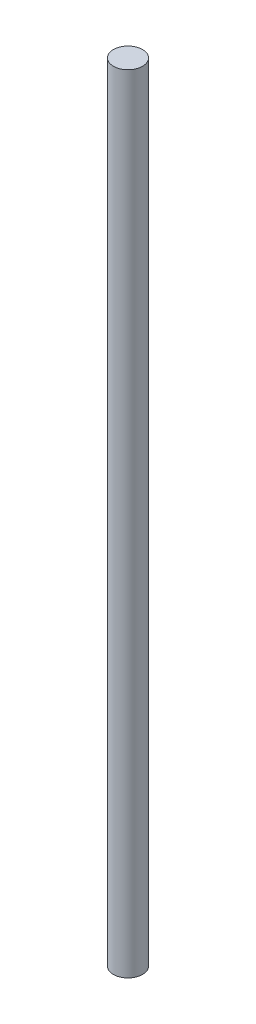
ISO-10303-21;
HEADER;
FILE_DESCRIPTION(('STEP AP214'),'2;1');
FILE_NAME('part.step','',(''),(''),'','','');
FILE_SCHEMA(('AUTOMOTIVE_DESIGN { 1 0 10303 214 1 1 1 1 }'));
ENDSEC;
DATA;
#1=APPLICATION_CONTEXT('core data for automotive mechanical design processes');
#2=APPLICATION_PROTOCOL_DEFINITION('international standard','automotive_design',2000,#1);
#3=PRODUCT_CONTEXT('',#1,'mechanical');
#4=PRODUCT('Part','Part','',(#3));
#5=PRODUCT_RELATED_PRODUCT_CATEGORY('part','',(#4));
#6=PRODUCT_DEFINITION_FORMATION('','',#4);
#7=PRODUCT_DEFINITION_CONTEXT('part definition',#1,'design');
#8=PRODUCT_DEFINITION('design','',#6,#7);
#9=PRODUCT_DEFINITION_SHAPE('','',#8);
#10=(LENGTH_UNIT() NAMED_UNIT(*) SI_UNIT(.MILLI.,.METRE.));
#11=(NAMED_UNIT(*) PLANE_ANGLE_UNIT() SI_UNIT($,.RADIAN.));
#12=(NAMED_UNIT(*) SI_UNIT($,.STERADIAN.) SOLID_ANGLE_UNIT());
#13=UNCERTAINTY_MEASURE_WITH_UNIT(LENGTH_MEASURE(1.E-05),#10,'distance_accuracy_value','');
#14=(GEOMETRIC_REPRESENTATION_CONTEXT(3) GLOBAL_UNCERTAINTY_ASSIGNED_CONTEXT((#13)) GLOBAL_UNIT_ASSIGNED_CONTEXT((#10,
#11,#12)) REPRESENTATION_CONTEXT('',''));
#15=CARTESIAN_POINT('',(0.,0.,0.));
#16=DIRECTION('',(0.,0.,1.));
#17=DIRECTION('',(1.,0.,0.));
#18=AXIS2_PLACEMENT_3D('',#15,#16,#17);
#19=CARTESIAN_POINT('',(0.,265.,0.));
#20=DIRECTION('',(0.,-1.,0.));
#21=DIRECTION('',(0.,0.,-1.));
#22=AXIS2_PLACEMENT_3D('',#19,#20,#21);
#23=CYLINDRICAL_SURFACE('',#22,4.9);
#24=CARTESIAN_POINT('',(0.,265.,0.));
#25=DIRECTION('',(0.,1.,0.));
#26=DIRECTION('',(0.,0.,1.));
#27=AXIS2_PLACEMENT_3D('',#24,#25,#26);
#28=CIRCLE('',#27,4.9);
#29=CARTESIAN_POINT('',(0.,265.,4.9));
#30=VERTEX_POINT('',#29);
#31=EDGE_CURVE('E10',#30,#30,#28,.T.);
#32=ORIENTED_EDGE('',*,*,#31,.F.);
#33=EDGE_LOOP('',(#32));
#34=FACE_BOUND('',#33,.T.);
#35=CARTESIAN_POINT('',(0.,0.,0.));
#36=DIRECTION('',(0.,1.,0.));
#37=DIRECTION('',(0.,0.,1.));
#38=AXIS2_PLACEMENT_3D('',#35,#36,#37);
#39=CIRCLE('',#38,4.9);
#40=CARTESIAN_POINT('',(0.,0.,4.9));
#41=VERTEX_POINT('',#40);
#42=EDGE_CURVE('E34',#41,#41,#39,.T.);
#43=ORIENTED_EDGE('',*,*,#42,.T.);
#44=EDGE_LOOP('',(#43));
#45=FACE_BOUND('',#44,.T.);
#46=ADVANCED_FACE('F31',(#34,#45),#23,.T.);
#47=CARTESIAN_POINT('',(0.,265.,0.));
#48=DIRECTION('',(0.,1.,0.));
#49=DIRECTION('',(0.,0.,1.));
#50=AXIS2_PLACEMENT_3D('',#47,#48,#49);
#51=PLANE('',#50);
#52=ORIENTED_EDGE('',*,*,#31,.T.);
#53=EDGE_LOOP('',(#52));
#54=FACE_BOUND('',#53,.T.);
#55=ADVANCED_FACE('F46',(#54),#51,.T.);
#56=CARTESIAN_POINT('',(0.,0.,0.));
#57=DIRECTION('',(0.,1.,0.));
#58=DIRECTION('',(0.,0.,1.));
#59=AXIS2_PLACEMENT_3D('',#56,#57,#58);
#60=PLANE('',#59);
#61=ORIENTED_EDGE('',*,*,#42,.F.);
#62=EDGE_LOOP('',(#61));
#63=FACE_BOUND('',#62,.T.);
#64=ADVANCED_FACE('F44',(#63),#60,.F.);
#65=CLOSED_SHELL('',(#46,#55,#64));
#66=MANIFOLD_SOLID_BREP('B2',#65);
#67=ADVANCED_BREP_SHAPE_REPRESENTATION('',(#18,#66),#14);
#68=SHAPE_DEFINITION_REPRESENTATION(#9,#67);
ENDSEC;
END-ISO-10303-21;
